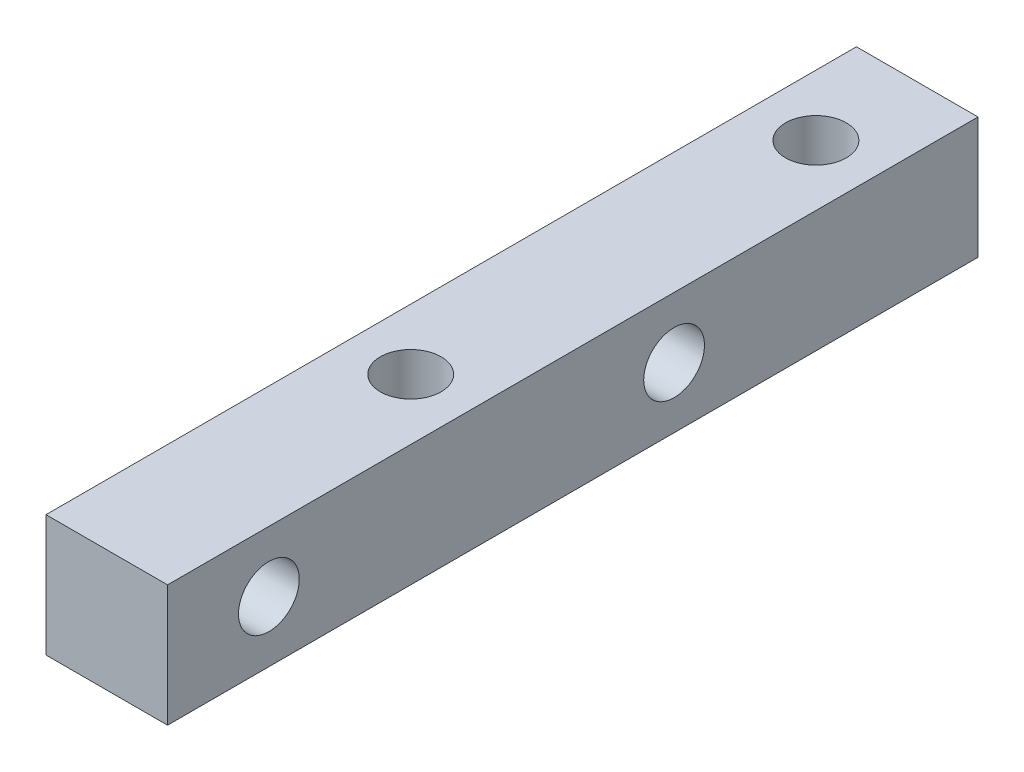
ISO-10303-21;
HEADER;
FILE_DESCRIPTION(('STEP AP214'),'2;1');
FILE_NAME('part.step','',(''),(''),'','','');
FILE_SCHEMA(('AUTOMOTIVE_DESIGN { 1 0 10303 214 1 1 1 1 }'));
ENDSEC;
DATA;
#1=APPLICATION_CONTEXT('core data for automotive mechanical design processes');
#2=APPLICATION_PROTOCOL_DEFINITION('international standard','automotive_design',2000,#1);
#3=PRODUCT_CONTEXT('',#1,'mechanical');
#4=PRODUCT('Part','Part','',(#3));
#5=PRODUCT_RELATED_PRODUCT_CATEGORY('part','',(#4));
#6=PRODUCT_DEFINITION_FORMATION('','',#4);
#7=PRODUCT_DEFINITION_CONTEXT('part definition',#1,'design');
#8=PRODUCT_DEFINITION('design','',#6,#7);
#9=PRODUCT_DEFINITION_SHAPE('','',#8);
#10=(LENGTH_UNIT() NAMED_UNIT(*) SI_UNIT(.MILLI.,.METRE.));
#11=(NAMED_UNIT(*) PLANE_ANGLE_UNIT() SI_UNIT($,.RADIAN.));
#12=(NAMED_UNIT(*) SI_UNIT($,.STERADIAN.) SOLID_ANGLE_UNIT());
#13=UNCERTAINTY_MEASURE_WITH_UNIT(LENGTH_MEASURE(1.E-05),#10,'distance_accuracy_value','');
#14=(GEOMETRIC_REPRESENTATION_CONTEXT(3) GLOBAL_UNCERTAINTY_ASSIGNED_CONTEXT((#13)) GLOBAL_UNIT_ASSIGNED_CONTEXT((#10,
#11,#12)) REPRESENTATION_CONTEXT('',''));
#15=CARTESIAN_POINT('',(0.,0.,0.));
#16=DIRECTION('',(0.,0.,1.));
#17=DIRECTION('',(1.,0.,0.));
#18=AXIS2_PLACEMENT_3D('',#15,#16,#17);
#19=CARTESIAN_POINT('',(0.,0.,40.));
#20=DIRECTION('',(1.,0.,0.));
#21=DIRECTION('',(0.,0.,-1.));
#22=AXIS2_PLACEMENT_3D('',#19,#20,#21);
#23=PLANE('',#22);
#24=CARTESIAN_POINT('',(0.,3.,35.));
#25=DIRECTION('',(-1.,0.,0.));
#26=DIRECTION('',(0.,0.,1.));
#27=AXIS2_PLACEMENT_3D('',#24,#25,#26);
#28=CIRCLE('',#27,1.5);
#29=CARTESIAN_POINT('',(0.,3.,36.5));
#30=VERTEX_POINT('',#29);
#31=EDGE_CURVE('E112',#30,#30,#28,.T.);
#32=ORIENTED_EDGE('',*,*,#31,.F.);
#33=EDGE_LOOP('',(#32));
#34=FACE_BOUND('',#33,.T.);
#35=CARTESIAN_POINT('',(0.,3.,15.));
#36=DIRECTION('',(-1.,0.,0.));
#37=DIRECTION('',(0.,0.,1.));
#38=AXIS2_PLACEMENT_3D('',#35,#36,#37);
#39=CIRCLE('',#38,1.5);
#40=CARTESIAN_POINT('',(0.,3.,16.5));
#41=VERTEX_POINT('',#40);
#42=EDGE_CURVE('E118',#41,#41,#39,.T.);
#43=ORIENTED_EDGE('',*,*,#42,.F.);
#44=EDGE_LOOP('',(#43));
#45=FACE_BOUND('',#44,.T.);
#46=DIRECTION('',(0.,-1.,0.));
#47=VECTOR('',#46,1.);
#48=CARTESIAN_POINT('',(0.,0.,0.));
#49=LINE('',#48,#47);
#50=CARTESIAN_POINT('',(0.,6.,0.));
#51=VERTEX_POINT('',#50);
#52=CARTESIAN_POINT('',(0.,0.,0.));
#53=VERTEX_POINT('',#52);
#54=EDGE_CURVE('E102',#51,#53,#49,.T.);
#55=ORIENTED_EDGE('',*,*,#54,.T.);
#56=DIRECTION('',(0.,0.,-1.));
#57=VECTOR('',#56,1.);
#58=CARTESIAN_POINT('',(0.,0.,40.));
#59=LINE('',#58,#57);
#60=CARTESIAN_POINT('',(0.,0.,40.));
#61=VERTEX_POINT('',#60);
#62=EDGE_CURVE('E11',#61,#53,#59,.T.);
#63=ORIENTED_EDGE('',*,*,#62,.F.);
#64=DIRECTION('',(0.,-1.,0.));
#65=VECTOR('',#64,1.);
#66=CARTESIAN_POINT('',(0.,0.,40.));
#67=LINE('',#66,#65);
#68=CARTESIAN_POINT('',(0.,6.,40.));
#69=VERTEX_POINT('',#68);
#70=EDGE_CURVE('E89',#69,#61,#67,.T.);
#71=ORIENTED_EDGE('',*,*,#70,.F.);
#72=DIRECTION('',(0.,0.,-1.));
#73=VECTOR('',#72,1.);
#74=CARTESIAN_POINT('',(0.,6.,40.));
#75=LINE('',#74,#73);
#76=EDGE_CURVE('E98',#69,#51,#75,.T.);
#77=ORIENTED_EDGE('',*,*,#76,.T.);
#78=EDGE_LOOP('',(#55,#63,#71,#77));
#79=FACE_BOUND('',#78,.T.);
#80=ADVANCED_FACE('F36',(#34,#45,#79),#23,.F.);
#81=CARTESIAN_POINT('',(0.,0.,40.));
#82=DIRECTION('',(0.,1.,0.));
#83=DIRECTION('',(0.,0.,1.));
#84=AXIS2_PLACEMENT_3D('',#81,#82,#83);
#85=PLANE('',#84);
#86=CARTESIAN_POINT('',(3.,0.,5.));
#87=DIRECTION('',(0.,1.,0.));
#88=DIRECTION('',(0.,0.,1.));
#89=AXIS2_PLACEMENT_3D('',#86,#87,#88);
#90=CIRCLE('',#89,1.5);
#91=CARTESIAN_POINT('',(3.,0.,6.5));
#92=VERTEX_POINT('',#91);
#93=EDGE_CURVE('E105',#92,#92,#90,.T.);
#94=ORIENTED_EDGE('',*,*,#93,.T.);
#95=EDGE_LOOP('',(#94));
#96=FACE_BOUND('',#95,.T.);
#97=CARTESIAN_POINT('',(3.,0.,25.));
#98=DIRECTION('',(0.,1.,0.));
#99=DIRECTION('',(0.,0.,1.));
#100=AXIS2_PLACEMENT_3D('',#97,#98,#99);
#101=CIRCLE('',#100,1.5);
#102=CARTESIAN_POINT('',(3.,0.,26.5));
#103=VERTEX_POINT('',#102);
#104=EDGE_CURVE('E128',#103,#103,#101,.T.);
#105=ORIENTED_EDGE('',*,*,#104,.T.);
#106=EDGE_LOOP('',(#105));
#107=FACE_BOUND('',#106,.T.);
#108=DIRECTION('',(1.,0.,0.));
#109=VECTOR('',#108,1.);
#110=CARTESIAN_POINT('',(0.,0.,0.));
#111=LINE('',#110,#109);
#112=CARTESIAN_POINT('',(6.,0.,0.));
#113=VERTEX_POINT('',#112);
#114=EDGE_CURVE('E93',#53,#113,#111,.T.);
#115=ORIENTED_EDGE('',*,*,#114,.T.);
#116=DIRECTION('',(0.,0.,-1.));
#117=VECTOR('',#116,1.);
#118=CARTESIAN_POINT('',(6.,0.,40.));
#119=LINE('',#118,#117);
#120=CARTESIAN_POINT('',(6.,0.,40.));
#121=VERTEX_POINT('',#120);
#122=EDGE_CURVE('E45',#121,#113,#119,.T.);
#123=ORIENTED_EDGE('',*,*,#122,.F.);
#124=DIRECTION('',(1.,0.,0.));
#125=VECTOR('',#124,1.);
#126=CARTESIAN_POINT('',(0.,0.,40.));
#127=LINE('',#126,#125);
#128=EDGE_CURVE('E84',#61,#121,#127,.T.);
#129=ORIENTED_EDGE('',*,*,#128,.F.);
#130=ORIENTED_EDGE('',*,*,#62,.T.);
#131=EDGE_LOOP('',(#115,#123,#129,#130));
#132=FACE_BOUND('',#131,.T.);
#133=ADVANCED_FACE('F92',(#96,#107,#132),#85,.F.);
#134=CARTESIAN_POINT('',(6.,0.,40.));
#135=DIRECTION('',(-1.,0.,0.));
#136=DIRECTION('',(0.,0.,1.));
#137=AXIS2_PLACEMENT_3D('',#134,#135,#136);
#138=PLANE('',#137);
#139=CARTESIAN_POINT('',(6.,3.,35.));
#140=DIRECTION('',(-1.,0.,0.));
#141=DIRECTION('',(0.,0.,1.));
#142=AXIS2_PLACEMENT_3D('',#139,#140,#141);
#143=CIRCLE('',#142,1.5);
#144=CARTESIAN_POINT('',(6.,3.,36.5));
#145=VERTEX_POINT('',#144);
#146=EDGE_CURVE('E39',#145,#145,#143,.T.);
#147=ORIENTED_EDGE('',*,*,#146,.T.);
#148=EDGE_LOOP('',(#147));
#149=FACE_BOUND('',#148,.T.);
#150=CARTESIAN_POINT('',(6.,3.,15.));
#151=DIRECTION('',(-1.,0.,0.));
#152=DIRECTION('',(0.,0.,1.));
#153=AXIS2_PLACEMENT_3D('',#150,#151,#152);
#154=CIRCLE('',#153,1.5);
#155=CARTESIAN_POINT('',(6.,3.,16.5));
#156=VERTEX_POINT('',#155);
#157=EDGE_CURVE('E110',#156,#156,#154,.T.);
#158=ORIENTED_EDGE('',*,*,#157,.T.);
#159=EDGE_LOOP('',(#158));
#160=FACE_BOUND('',#159,.T.);
#161=DIRECTION('',(0.,1.,0.));
#162=VECTOR('',#161,1.);
#163=CARTESIAN_POINT('',(6.,0.,0.));
#164=LINE('',#163,#162);
#165=CARTESIAN_POINT('',(6.,6.,0.));
#166=VERTEX_POINT('',#165);
#167=EDGE_CURVE('E71',#113,#166,#164,.T.);
#168=ORIENTED_EDGE('',*,*,#167,.T.);
#169=DIRECTION('',(0.,0.,-1.));
#170=VECTOR('',#169,1.);
#171=CARTESIAN_POINT('',(6.,6.,40.));
#172=LINE('',#171,#170);
#173=CARTESIAN_POINT('',(6.,6.,40.));
#174=VERTEX_POINT('',#173);
#175=EDGE_CURVE('E94',#174,#166,#172,.T.);
#176=ORIENTED_EDGE('',*,*,#175,.F.);
#177=DIRECTION('',(0.,1.,0.));
#178=VECTOR('',#177,1.);
#179=CARTESIAN_POINT('',(6.,0.,40.));
#180=LINE('',#179,#178);
#181=EDGE_CURVE('E87',#121,#174,#180,.T.);
#182=ORIENTED_EDGE('',*,*,#181,.F.);
#183=ORIENTED_EDGE('',*,*,#122,.T.);
#184=EDGE_LOOP('',(#168,#176,#182,#183));
#185=FACE_BOUND('',#184,.T.);
#186=ADVANCED_FACE('F96',(#149,#160,#185),#138,.F.);
#187=CARTESIAN_POINT('',(0.,6.,40.));
#188=DIRECTION('',(0.,-1.,0.));
#189=DIRECTION('',(0.,0.,-1.));
#190=AXIS2_PLACEMENT_3D('',#187,#188,#189);
#191=PLANE('',#190);
#192=CARTESIAN_POINT('',(3.,6.,5.));
#193=DIRECTION('',(0.,1.,0.));
#194=DIRECTION('',(0.,0.,1.));
#195=AXIS2_PLACEMENT_3D('',#192,#193,#194);
#196=CIRCLE('',#195,1.5);
#197=CARTESIAN_POINT('',(3.,6.,6.5));
#198=VERTEX_POINT('',#197);
#199=EDGE_CURVE('E125',#198,#198,#196,.T.);
#200=ORIENTED_EDGE('',*,*,#199,.F.);
#201=EDGE_LOOP('',(#200));
#202=FACE_BOUND('',#201,.T.);
#203=CARTESIAN_POINT('',(3.,6.,25.));
#204=DIRECTION('',(0.,1.,0.));
#205=DIRECTION('',(0.,0.,1.));
#206=AXIS2_PLACEMENT_3D('',#203,#204,#205);
#207=CIRCLE('',#206,1.5);
#208=CARTESIAN_POINT('',(3.,6.,26.5));
#209=VERTEX_POINT('',#208);
#210=EDGE_CURVE('E116',#209,#209,#207,.T.);
#211=ORIENTED_EDGE('',*,*,#210,.F.);
#212=EDGE_LOOP('',(#211));
#213=FACE_BOUND('',#212,.T.);
#214=DIRECTION('',(-1.,0.,0.));
#215=VECTOR('',#214,1.);
#216=CARTESIAN_POINT('',(0.,6.,0.));
#217=LINE('',#216,#215);
#218=EDGE_CURVE('E77',#166,#51,#217,.T.);
#219=ORIENTED_EDGE('',*,*,#218,.T.);
#220=ORIENTED_EDGE('',*,*,#76,.F.);
#221=DIRECTION('',(-1.,0.,0.));
#222=VECTOR('',#221,1.);
#223=CARTESIAN_POINT('',(0.,6.,40.));
#224=LINE('',#223,#222);
#225=EDGE_CURVE('E54',#174,#69,#224,.T.);
#226=ORIENTED_EDGE('',*,*,#225,.F.);
#227=ORIENTED_EDGE('',*,*,#175,.T.);
#228=EDGE_LOOP('',(#219,#220,#226,#227));
#229=FACE_BOUND('',#228,.T.);
#230=ADVANCED_FACE('F169',(#202,#213,#229),#191,.F.);
#231=CARTESIAN_POINT('',(0.,0.,40.));
#232=DIRECTION('',(0.,0.,-1.));
#233=DIRECTION('',(-1.,0.,0.));
#234=AXIS2_PLACEMENT_3D('',#231,#232,#233);
#235=PLANE('',#234);
#236=ORIENTED_EDGE('',*,*,#70,.T.);
#237=ORIENTED_EDGE('',*,*,#128,.T.);
#238=ORIENTED_EDGE('',*,*,#181,.T.);
#239=ORIENTED_EDGE('',*,*,#225,.T.);
#240=EDGE_LOOP('',(#236,#237,#238,#239));
#241=FACE_BOUND('',#240,.T.);
#242=ADVANCED_FACE('F85',(#241),#235,.F.);
#243=CARTESIAN_POINT('',(0.,0.,0.));
#244=DIRECTION('',(0.,0.,-1.));
#245=DIRECTION('',(-1.,0.,0.));
#246=AXIS2_PLACEMENT_3D('',#243,#244,#245);
#247=PLANE('',#246);
#248=ORIENTED_EDGE('',*,*,#54,.F.);
#249=ORIENTED_EDGE('',*,*,#218,.F.);
#250=ORIENTED_EDGE('',*,*,#167,.F.);
#251=ORIENTED_EDGE('',*,*,#114,.F.);
#252=EDGE_LOOP('',(#248,#249,#250,#251));
#253=FACE_BOUND('',#252,.T.);
#254=ADVANCED_FACE('F151',(#253),#247,.T.);
#255=CARTESIAN_POINT('',(3.,-44.,25.));
#256=DIRECTION('',(0.,1.,0.));
#257=DIRECTION('',(0.,0.,1.));
#258=AXIS2_PLACEMENT_3D('',#255,#256,#257);
#259=CYLINDRICAL_SURFACE('',#258,1.5);
#260=ORIENTED_EDGE('',*,*,#210,.T.);
#261=EDGE_LOOP('',(#260));
#262=FACE_BOUND('',#261,.T.);
#263=ORIENTED_EDGE('',*,*,#104,.F.);
#264=EDGE_LOOP('',(#263));
#265=FACE_BOUND('',#264,.T.);
#266=ADVANCED_FACE('F141',(#262,#265),#259,.F.);
#267=CARTESIAN_POINT('',(3.,-44.,5.));
#268=DIRECTION('',(0.,1.,0.));
#269=DIRECTION('',(0.,0.,1.));
#270=AXIS2_PLACEMENT_3D('',#267,#268,#269);
#271=CYLINDRICAL_SURFACE('',#270,1.5);
#272=ORIENTED_EDGE('',*,*,#199,.T.);
#273=EDGE_LOOP('',(#272));
#274=FACE_BOUND('',#273,.T.);
#275=ORIENTED_EDGE('',*,*,#93,.F.);
#276=EDGE_LOOP('',(#275));
#277=FACE_BOUND('',#276,.T.);
#278=ADVANCED_FACE('F138',(#274,#277),#271,.F.);
#279=CARTESIAN_POINT('',(50.,3.,15.));
#280=DIRECTION('',(-1.,0.,0.));
#281=DIRECTION('',(0.,0.,1.));
#282=AXIS2_PLACEMENT_3D('',#279,#280,#281);
#283=CYLINDRICAL_SURFACE('',#282,1.5);
#284=ORIENTED_EDGE('',*,*,#42,.T.);
#285=EDGE_LOOP('',(#284));
#286=FACE_BOUND('',#285,.T.);
#287=ORIENTED_EDGE('',*,*,#157,.F.);
#288=EDGE_LOOP('',(#287));
#289=FACE_BOUND('',#288,.T.);
#290=ADVANCED_FACE('F140',(#286,#289),#283,.F.);
#291=CARTESIAN_POINT('',(50.,3.,35.));
#292=DIRECTION('',(-1.,0.,0.));
#293=DIRECTION('',(0.,0.,1.));
#294=AXIS2_PLACEMENT_3D('',#291,#292,#293);
#295=CYLINDRICAL_SURFACE('',#294,1.5);
#296=ORIENTED_EDGE('',*,*,#31,.T.);
#297=EDGE_LOOP('',(#296));
#298=FACE_BOUND('',#297,.T.);
#299=ORIENTED_EDGE('',*,*,#146,.F.);
#300=EDGE_LOOP('',(#299));
#301=FACE_BOUND('',#300,.T.);
#302=ADVANCED_FACE('F148',(#298,#301),#295,.F.);
#303=CLOSED_SHELL('',(#80,#133,#186,#230,#242,#254,#266,#278,#290,#302));
#304=MANIFOLD_SOLID_BREP('B2',#303);
#305=ADVANCED_BREP_SHAPE_REPRESENTATION('',(#18,#304),#14);
#306=SHAPE_DEFINITION_REPRESENTATION(#9,#305);
ENDSEC;
END-ISO-10303-21;
